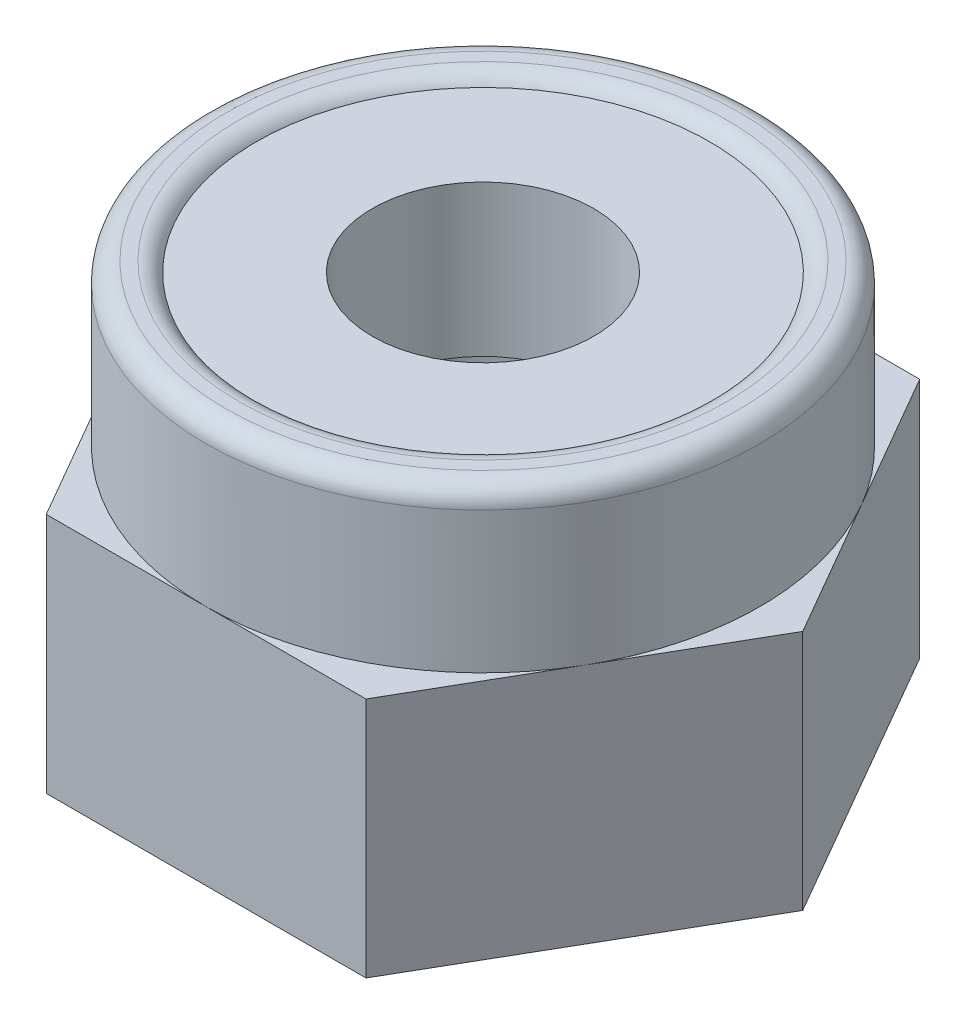
ISO-10303-21;
HEADER;
FILE_DESCRIPTION(('STEP AP214'),'2;1');
FILE_NAME('part.step','',(''),(''),'','','');
FILE_SCHEMA(('AUTOMOTIVE_DESIGN { 1 0 10303 214 1 1 1 1 }'));
ENDSEC;
DATA;
#1=APPLICATION_CONTEXT('core data for automotive mechanical design processes');
#2=APPLICATION_PROTOCOL_DEFINITION('international standard','automotive_design',2000,#1);
#3=PRODUCT_CONTEXT('',#1,'mechanical');
#4=PRODUCT('Part','Part','',(#3));
#5=PRODUCT_RELATED_PRODUCT_CATEGORY('part','',(#4));
#6=PRODUCT_DEFINITION_FORMATION('','',#4);
#7=PRODUCT_DEFINITION_CONTEXT('part definition',#1,'design');
#8=PRODUCT_DEFINITION('design','',#6,#7);
#9=PRODUCT_DEFINITION_SHAPE('','',#8);
#10=(LENGTH_UNIT() NAMED_UNIT(*) SI_UNIT(.MILLI.,.METRE.));
#11=(NAMED_UNIT(*) PLANE_ANGLE_UNIT() SI_UNIT($,.RADIAN.));
#12=(NAMED_UNIT(*) SI_UNIT($,.STERADIAN.) SOLID_ANGLE_UNIT());
#13=UNCERTAINTY_MEASURE_WITH_UNIT(LENGTH_MEASURE(1.E-05),#10,'distance_accuracy_value','');
#14=(GEOMETRIC_REPRESENTATION_CONTEXT(3) GLOBAL_UNCERTAINTY_ASSIGNED_CONTEXT((#13)) GLOBAL_UNIT_ASSIGNED_CONTEXT((#10,
#11,#12)) REPRESENTATION_CONTEXT('',''));
#15=CARTESIAN_POINT('',(0.,0.,0.));
#16=DIRECTION('',(0.,0.,1.));
#17=DIRECTION('',(1.,0.,0.));
#18=AXIS2_PLACEMENT_3D('',#15,#16,#17);
#19=CARTESIAN_POINT('',(0.,4.,0.));
#20=DIRECTION('',(0.,-1.,0.));
#21=DIRECTION('',(0.,0.,-1.));
#22=AXIS2_PLACEMENT_3D('',#19,#20,#21);
#23=CYLINDRICAL_SURFACE('',#22,1.1);
#24=CARTESIAN_POINT('',(0.,2.4,0.));
#25=DIRECTION('',(0.,1.,0.));
#26=DIRECTION('',(0.,0.,1.));
#27=AXIS2_PLACEMENT_3D('',#24,#25,#26);
#28=CIRCLE('',#27,1.1);
#29=CARTESIAN_POINT('',(0.,2.4,1.1));
#30=VERTEX_POINT('',#29);
#31=EDGE_CURVE('E134',#30,#30,#28,.T.);
#32=ORIENTED_EDGE('',*,*,#31,.F.);
#33=EDGE_LOOP('',(#32));
#34=FACE_BOUND('',#33,.T.);
#35=CARTESIAN_POINT('',(0.,3.9,0.));
#36=DIRECTION('',(0.,1.,0.));
#37=DIRECTION('',(0.,0.,1.));
#38=AXIS2_PLACEMENT_3D('',#35,#36,#37);
#39=CIRCLE('',#38,1.1);
#40=CARTESIAN_POINT('',(0.,3.9,1.1));
#41=VERTEX_POINT('',#40);
#42=EDGE_CURVE('E414',#41,#41,#39,.T.);
#43=ORIENTED_EDGE('',*,*,#42,.T.);
#44=EDGE_LOOP('',(#43));
#45=FACE_BOUND('',#44,.T.);
#46=ADVANCED_FACE('F34',(#34,#45),#23,.F.);
#47=CARTESIAN_POINT('',(-1.58771324027148,2.4,-2.75000000000001));
#48=DIRECTION('',(0.,1.,0.));
#49=DIRECTION('',(0.,0.,1.));
#50=AXIS2_PLACEMENT_3D('',#47,#48,#49);
#51=PLANE('',#50);
#52=CARTESIAN_POINT('',(0.,2.4,0.));
#53=DIRECTION('',(0.,1.,0.));
#54=DIRECTION('',(0.,0.,1.));
#55=AXIS2_PLACEMENT_3D('',#52,#53,#54);
#56=CIRCLE('',#55,2.74999999999999);
#57=CARTESIAN_POINT('',(0.,2.4,2.74999999999999));
#58=VERTEX_POINT('',#57);
#59=CARTESIAN_POINT('',(2.3815698604072,2.4,1.375));
#60=VERTEX_POINT('',#59);
#61=EDGE_CURVE('E129',#58,#60,#56,.T.);
#62=ORIENTED_EDGE('',*,*,#61,.F.);
#63=DIRECTION('',(1.,0.,0.));
#64=VECTOR('',#63,1.);
#65=CARTESIAN_POINT('',(-1.58771324027148,2.4,2.74999999999999));
#66=LINE('',#65,#64);
#67=CARTESIAN_POINT('',(1.58771324027147,2.4,2.74999999999999));
#68=VERTEX_POINT('',#67);
#69=EDGE_CURVE('E117',#58,#68,#66,.T.);
#70=ORIENTED_EDGE('',*,*,#69,.T.);
#71=DIRECTION('',(0.500000000000001,0.,-0.866025403784438));
#72=VECTOR('',#71,1.);
#73=CARTESIAN_POINT('',(1.58771324027147,2.4,2.74999999999999));
#74=LINE('',#73,#72);
#75=EDGE_CURVE('E131',#68,#60,#74,.T.);
#76=ORIENTED_EDGE('',*,*,#75,.T.);
#77=EDGE_LOOP('',(#62,#70,#76));
#78=FACE_BOUND('',#77,.T.);
#79=ADVANCED_FACE('F130',(#78),#51,.T.);
#80=CARTESIAN_POINT('',(2.3815698604072,2.4,-1.375));
#81=VERTEX_POINT('',#80);
#82=EDGE_CURVE('E57',#60,#81,#56,.T.);
#83=ORIENTED_EDGE('',*,*,#82,.F.);
#84=CARTESIAN_POINT('',(3.17542648054293,2.4,0.));
#85=VERTEX_POINT('',#84);
#86=EDGE_CURVE('E116',#60,#85,#74,.T.);
#87=ORIENTED_EDGE('',*,*,#86,.T.);
#88=DIRECTION('',(-0.5,0.,-0.866025403784439));
#89=VECTOR('',#88,1.);
#90=CARTESIAN_POINT('',(3.17542648054293,2.4,0.));
#91=LINE('',#90,#89);
#92=EDGE_CURVE('E165',#85,#81,#91,.T.);
#93=ORIENTED_EDGE('',*,*,#92,.T.);
#94=EDGE_LOOP('',(#83,#87,#93));
#95=FACE_BOUND('',#94,.T.);
#96=ADVANCED_FACE('F217',(#95),#51,.T.);
#97=CARTESIAN_POINT('',(0.,2.4,-2.75));
#98=VERTEX_POINT('',#97);
#99=EDGE_CURVE('E49',#81,#98,#56,.T.);
#100=ORIENTED_EDGE('',*,*,#99,.F.);
#101=CARTESIAN_POINT('',(1.58771324027146,2.4,-2.75));
#102=VERTEX_POINT('',#101);
#103=EDGE_CURVE('E164',#81,#102,#91,.T.);
#104=ORIENTED_EDGE('',*,*,#103,.T.);
#105=DIRECTION('',(-1.,0.,0.));
#106=VECTOR('',#105,1.);
#107=CARTESIAN_POINT('',(1.58771324027146,2.4,-2.75));
#108=LINE('',#107,#106);
#109=EDGE_CURVE('E154',#102,#98,#108,.T.);
#110=ORIENTED_EDGE('',*,*,#109,.T.);
#111=EDGE_LOOP('',(#100,#104,#110));
#112=FACE_BOUND('',#111,.T.);
#113=ADVANCED_FACE('F278',(#112),#51,.T.);
#114=CARTESIAN_POINT('',(-2.38156986040722,2.4,-1.37500000000001));
#115=VERTEX_POINT('',#114);
#116=EDGE_CURVE('E141',#98,#115,#56,.T.);
#117=ORIENTED_EDGE('',*,*,#116,.F.);
#118=CARTESIAN_POINT('',(-1.58771324027148,2.4,-2.75000000000001));
#119=VERTEX_POINT('',#118);
#120=EDGE_CURVE('E157',#98,#119,#108,.T.);
#121=ORIENTED_EDGE('',*,*,#120,.T.);
#122=DIRECTION('',(-0.5,0.,0.866025403784439));
#123=VECTOR('',#122,1.);
#124=CARTESIAN_POINT('',(-1.58771324027148,2.4,-2.75000000000001));
#125=LINE('',#124,#123);
#126=EDGE_CURVE('E158',#119,#115,#125,.T.);
#127=ORIENTED_EDGE('',*,*,#126,.T.);
#128=EDGE_LOOP('',(#117,#121,#127));
#129=FACE_BOUND('',#128,.T.);
#130=ADVANCED_FACE('F277',(#129),#51,.T.);
#131=CARTESIAN_POINT('',(-2.38156986040721,2.4,1.375));
#132=VERTEX_POINT('',#131);
#133=EDGE_CURVE('E139',#115,#132,#56,.T.);
#134=ORIENTED_EDGE('',*,*,#133,.F.);
#135=CARTESIAN_POINT('',(-3.17542648054295,2.4,0.));
#136=VERTEX_POINT('',#135);
#137=EDGE_CURVE('E156',#115,#136,#125,.T.);
#138=ORIENTED_EDGE('',*,*,#137,.T.);
#139=DIRECTION('',(0.5,0.,0.866025403784438));
#140=VECTOR('',#139,1.);
#141=CARTESIAN_POINT('',(-3.17542648054295,2.4,0.));
#142=LINE('',#141,#140);
#143=EDGE_CURVE('E127',#136,#132,#142,.T.);
#144=ORIENTED_EDGE('',*,*,#143,.T.);
#145=EDGE_LOOP('',(#134,#138,#144));
#146=FACE_BOUND('',#145,.T.);
#147=ADVANCED_FACE('F238',(#146),#51,.T.);
#148=EDGE_CURVE('E110',#132,#58,#56,.T.);
#149=ORIENTED_EDGE('',*,*,#148,.F.);
#150=CARTESIAN_POINT('',(-1.58771324027148,2.4,2.74999999999999));
#151=VERTEX_POINT('',#150);
#152=EDGE_CURVE('E112',#132,#151,#142,.T.);
#153=ORIENTED_EDGE('',*,*,#152,.T.);
#154=EDGE_CURVE('E106',#151,#58,#66,.T.);
#155=ORIENTED_EDGE('',*,*,#154,.T.);
#156=EDGE_LOOP('',(#149,#153,#155));
#157=FACE_BOUND('',#156,.T.);
#158=ADVANCED_FACE('F108',(#157),#51,.T.);
#159=CARTESIAN_POINT('',(-1.58771324027148,0.,-2.75000000000001));
#160=DIRECTION('',(0.,1.,0.));
#161=DIRECTION('',(0.,0.,1.));
#162=AXIS2_PLACEMENT_3D('',#159,#160,#161);
#163=PLANE('',#162);
#164=DIRECTION('',(-1.,0.,0.));
#165=VECTOR('',#164,1.);
#166=CARTESIAN_POINT('',(1.58771324027146,0.,-2.75));
#167=LINE('',#166,#165);
#168=CARTESIAN_POINT('',(1.58771324027146,0.,-2.75));
#169=VERTEX_POINT('',#168);
#170=CARTESIAN_POINT('',(-1.58771324027148,0.,-2.75000000000001));
#171=VERTEX_POINT('',#170);
#172=EDGE_CURVE('E153',#169,#171,#167,.T.);
#173=ORIENTED_EDGE('',*,*,#172,.F.);
#174=DIRECTION('',(-0.5,0.,-0.866025403784439));
#175=VECTOR('',#174,1.);
#176=CARTESIAN_POINT('',(3.17542648054293,0.,0.));
#177=LINE('',#176,#175);
#178=CARTESIAN_POINT('',(3.17542648054293,0.,0.));
#179=VERTEX_POINT('',#178);
#180=EDGE_CURVE('E178',#179,#169,#177,.T.);
#181=ORIENTED_EDGE('',*,*,#180,.F.);
#182=DIRECTION('',(0.500000000000001,0.,-0.866025403784438));
#183=VECTOR('',#182,1.);
#184=CARTESIAN_POINT('',(1.58771324027147,0.,2.74999999999999));
#185=LINE('',#184,#183);
#186=CARTESIAN_POINT('',(1.58771324027147,0.,2.74999999999999));
#187=VERTEX_POINT('',#186);
#188=EDGE_CURVE('E176',#187,#179,#185,.T.);
#189=ORIENTED_EDGE('',*,*,#188,.F.);
#190=DIRECTION('',(1.,0.,0.));
#191=VECTOR('',#190,1.);
#192=CARTESIAN_POINT('',(-1.58771324027148,0.,2.74999999999999));
#193=LINE('',#192,#191);
#194=CARTESIAN_POINT('',(-1.58771324027148,0.,2.74999999999999));
#195=VERTEX_POINT('',#194);
#196=EDGE_CURVE('E174',#195,#187,#193,.T.);
#197=ORIENTED_EDGE('',*,*,#196,.F.);
#198=DIRECTION('',(0.5,0.,0.866025403784438));
#199=VECTOR('',#198,1.);
#200=CARTESIAN_POINT('',(-3.17542648054295,0.,0.));
#201=LINE('',#200,#199);
#202=CARTESIAN_POINT('',(-3.17542648054295,0.,0.));
#203=VERTEX_POINT('',#202);
#204=EDGE_CURVE('E172',#203,#195,#201,.T.);
#205=ORIENTED_EDGE('',*,*,#204,.F.);
#206=DIRECTION('',(-0.5,0.,0.866025403784439));
#207=VECTOR('',#206,1.);
#208=CARTESIAN_POINT('',(-1.58771324027148,0.,-2.75000000000001));
#209=LINE('',#208,#207);
#210=EDGE_CURVE('E170',#171,#203,#209,.T.);
#211=ORIENTED_EDGE('',*,*,#210,.F.);
#212=EDGE_LOOP('',(#173,#181,#189,#197,#205,#211));
#213=FACE_BOUND('',#212,.T.);
#214=CARTESIAN_POINT('',(0.,0.,0.));
#215=DIRECTION('',(0.,1.,0.));
#216=DIRECTION('',(0.,0.,1.));
#217=AXIS2_PLACEMENT_3D('',#214,#215,#216);
#218=CIRCLE('',#217,1.25);
#219=CARTESIAN_POINT('',(0.,0.,1.25));
#220=VERTEX_POINT('',#219);
#221=EDGE_CURVE('E150',#220,#220,#218,.T.);
#222=ORIENTED_EDGE('',*,*,#221,.T.);
#223=EDGE_LOOP('',(#222));
#224=FACE_BOUND('',#223,.T.);
#225=ADVANCED_FACE('F237',(#213,#224),#163,.F.);
#226=CARTESIAN_POINT('',(1.58771324027146,2.4,-2.75));
#227=DIRECTION('',(0.,0.,1.));
#228=DIRECTION('',(1.,0.,0.));
#229=AXIS2_PLACEMENT_3D('',#226,#227,#228);
#230=PLANE('',#229);
#231=ORIENTED_EDGE('',*,*,#172,.T.);
#232=DIRECTION('',(0.,-1.,0.));
#233=VECTOR('',#232,1.);
#234=CARTESIAN_POINT('',(-1.58771324027148,2.4,-2.75000000000001));
#235=LINE('',#234,#233);
#236=EDGE_CURVE('E140',#119,#171,#235,.T.);
#237=ORIENTED_EDGE('',*,*,#236,.F.);
#238=ORIENTED_EDGE('',*,*,#120,.F.);
#239=ORIENTED_EDGE('',*,*,#109,.F.);
#240=DIRECTION('',(0.,-1.,0.));
#241=VECTOR('',#240,1.);
#242=CARTESIAN_POINT('',(1.58771324027146,2.4,-2.75));
#243=LINE('',#242,#241);
#244=EDGE_CURVE('E167',#102,#169,#243,.T.);
#245=ORIENTED_EDGE('',*,*,#244,.T.);
#246=EDGE_LOOP('',(#231,#237,#238,#239,#245));
#247=FACE_BOUND('',#246,.T.);
#248=ADVANCED_FACE('F241',(#247),#230,.F.);
#249=CARTESIAN_POINT('',(-1.58771324027148,2.4,-2.75000000000001));
#250=DIRECTION('',(0.866025403784439,0.,0.5));
#251=DIRECTION('',(0.5,0.,-0.866025403784439));
#252=AXIS2_PLACEMENT_3D('',#249,#250,#251);
#253=PLANE('',#252);
#254=ORIENTED_EDGE('',*,*,#210,.T.);
#255=DIRECTION('',(0.,-1.,0.));
#256=VECTOR('',#255,1.);
#257=CARTESIAN_POINT('',(-3.17542648054295,2.4,0.));
#258=LINE('',#257,#256);
#259=EDGE_CURVE('E143',#136,#203,#258,.T.);
#260=ORIENTED_EDGE('',*,*,#259,.F.);
#261=ORIENTED_EDGE('',*,*,#137,.F.);
#262=ORIENTED_EDGE('',*,*,#126,.F.);
#263=ORIENTED_EDGE('',*,*,#236,.T.);
#264=EDGE_LOOP('',(#254,#260,#261,#262,#263));
#265=FACE_BOUND('',#264,.T.);
#266=ADVANCED_FACE('F255',(#265),#253,.F.);
#267=CARTESIAN_POINT('',(-3.17542648054295,2.4,0.));
#268=DIRECTION('',(0.866025403784438,0.,-0.5));
#269=DIRECTION('',(-0.5,0.,-0.866025403784439));
#270=AXIS2_PLACEMENT_3D('',#267,#268,#269);
#271=PLANE('',#270);
#272=ORIENTED_EDGE('',*,*,#204,.T.);
#273=DIRECTION('',(0.,-1.,0.));
#274=VECTOR('',#273,1.);
#275=CARTESIAN_POINT('',(-1.58771324027148,2.4,2.74999999999999));
#276=LINE('',#275,#274);
#277=EDGE_CURVE('E186',#151,#195,#276,.T.);
#278=ORIENTED_EDGE('',*,*,#277,.F.);
#279=ORIENTED_EDGE('',*,*,#152,.F.);
#280=ORIENTED_EDGE('',*,*,#143,.F.);
#281=ORIENTED_EDGE('',*,*,#259,.T.);
#282=EDGE_LOOP('',(#272,#278,#279,#280,#281));
#283=FACE_BOUND('',#282,.T.);
#284=ADVANCED_FACE('F252',(#283),#271,.F.);
#285=CARTESIAN_POINT('',(-1.58771324027148,2.4,2.74999999999999));
#286=DIRECTION('',(0.,0.,-1.));
#287=DIRECTION('',(-1.,0.,0.));
#288=AXIS2_PLACEMENT_3D('',#285,#286,#287);
#289=PLANE('',#288);
#290=ORIENTED_EDGE('',*,*,#196,.T.);
#291=DIRECTION('',(0.,-1.,0.));
#292=VECTOR('',#291,1.);
#293=CARTESIAN_POINT('',(1.58771324027147,2.4,2.74999999999999));
#294=LINE('',#293,#292);
#295=EDGE_CURVE('E123',#68,#187,#294,.T.);
#296=ORIENTED_EDGE('',*,*,#295,.F.);
#297=ORIENTED_EDGE('',*,*,#69,.F.);
#298=ORIENTED_EDGE('',*,*,#154,.F.);
#299=ORIENTED_EDGE('',*,*,#277,.T.);
#300=EDGE_LOOP('',(#290,#296,#297,#298,#299));
#301=FACE_BOUND('',#300,.T.);
#302=ADVANCED_FACE('F121',(#301),#289,.F.);
#303=CARTESIAN_POINT('',(1.58771324027147,2.4,2.74999999999999));
#304=DIRECTION('',(-0.866025403784438,0.,-0.500000000000001));
#305=DIRECTION('',(-0.500000000000001,0.,0.866025403784438));
#306=AXIS2_PLACEMENT_3D('',#303,#304,#305);
#307=PLANE('',#306);
#308=ORIENTED_EDGE('',*,*,#188,.T.);
#309=DIRECTION('',(0.,-1.,0.));
#310=VECTOR('',#309,1.);
#311=CARTESIAN_POINT('',(3.17542648054293,2.4,0.));
#312=LINE('',#311,#310);
#313=EDGE_CURVE('E182',#85,#179,#312,.T.);
#314=ORIENTED_EDGE('',*,*,#313,.F.);
#315=ORIENTED_EDGE('',*,*,#86,.F.);
#316=ORIENTED_EDGE('',*,*,#75,.F.);
#317=ORIENTED_EDGE('',*,*,#295,.T.);
#318=EDGE_LOOP('',(#308,#314,#315,#316,#317));
#319=FACE_BOUND('',#318,.T.);
#320=ADVANCED_FACE('F245',(#319),#307,.F.);
#321=CARTESIAN_POINT('',(3.17542648054293,2.4,0.));
#322=DIRECTION('',(-0.866025403784439,0.,0.5));
#323=DIRECTION('',(0.5,0.,0.866025403784439));
#324=AXIS2_PLACEMENT_3D('',#321,#322,#323);
#325=PLANE('',#324);
#326=ORIENTED_EDGE('',*,*,#180,.T.);
#327=ORIENTED_EDGE('',*,*,#244,.F.);
#328=ORIENTED_EDGE('',*,*,#103,.F.);
#329=ORIENTED_EDGE('',*,*,#92,.F.);
#330=ORIENTED_EDGE('',*,*,#313,.T.);
#331=EDGE_LOOP('',(#326,#327,#328,#329,#330));
#332=FACE_BOUND('',#331,.T.);
#333=ADVANCED_FACE('F233',(#332),#325,.F.);
#334=CARTESIAN_POINT('',(0.,2.4,0.));
#335=DIRECTION('',(0.,-1.,0.));
#336=DIRECTION('',(0.,0.,-1.));
#337=AXIS2_PLACEMENT_3D('',#334,#335,#336);
#338=CYLINDRICAL_SURFACE('',#337,1.25);
#339=CARTESIAN_POINT('',(0.,2.4,0.));
#340=DIRECTION('',(0.,1.,0.));
#341=DIRECTION('',(0.,0.,1.));
#342=AXIS2_PLACEMENT_3D('',#339,#340,#341);
#343=CIRCLE('',#342,1.25);
#344=CARTESIAN_POINT('',(0.,2.4,1.25));
#345=VERTEX_POINT('',#344);
#346=EDGE_CURVE('E133',#345,#345,#343,.T.);
#347=ORIENTED_EDGE('',*,*,#346,.T.);
#348=EDGE_LOOP('',(#347));
#349=FACE_BOUND('',#348,.T.);
#350=ORIENTED_EDGE('',*,*,#221,.F.);
#351=EDGE_LOOP('',(#350));
#352=FACE_BOUND('',#351,.T.);
#353=ADVANCED_FACE('F225',(#349,#352),#338,.F.);
#354=CARTESIAN_POINT('',(0.,4.,0.));
#355=DIRECTION('',(0.,1.,0.));
#356=DIRECTION('',(0.,0.,1.));
#357=AXIS2_PLACEMENT_3D('',#354,#355,#356);
#358=PLANE('',#357);
#359=CARTESIAN_POINT('',(0.,4.,0.));
#360=DIRECTION('',(0.,1.,0.));
#361=DIRECTION('',(0.,0.,1.));
#362=AXIS2_PLACEMENT_3D('',#359,#360,#361);
#363=CIRCLE('',#362,2.54999999999999);
#364=CARTESIAN_POINT('',(0.,4.,2.54999999999999));
#365=VERTEX_POINT('',#364);
#366=EDGE_CURVE('E42',#365,#365,#363,.T.);
#367=ORIENTED_EDGE('',*,*,#366,.T.);
#368=EDGE_LOOP('',(#367));
#369=FACE_BOUND('',#368,.T.);
#370=CARTESIAN_POINT('',(0.,4.,0.));
#371=DIRECTION('',(0.,1.,0.));
#372=DIRECTION('',(0.,0.,1.));
#373=AXIS2_PLACEMENT_3D('',#370,#371,#372);
#374=CIRCLE('',#373,2.42320508075689);
#375=CARTESIAN_POINT('',(0.,4.,2.42320508075689));
#376=VERTEX_POINT('',#375);
#377=EDGE_CURVE('E190',#376,#376,#374,.F.);
#378=ORIENTED_EDGE('',*,*,#377,.T.);
#379=EDGE_LOOP('',(#378));
#380=FACE_BOUND('',#379,.T.);
#381=ADVANCED_FACE('F195',(#369,#380),#358,.T.);
#382=CARTESIAN_POINT('',(0.,2.4,0.));
#383=DIRECTION('',(0.,1.,0.));
#384=DIRECTION('',(0.,0.,1.));
#385=AXIS2_PLACEMENT_3D('',#382,#383,#384);
#386=PLANE('',#385);
#387=ORIENTED_EDGE('',*,*,#346,.F.);
#388=EDGE_LOOP('',(#387));
#389=FACE_BOUND('',#388,.T.);
#390=ORIENTED_EDGE('',*,*,#31,.T.);
#391=EDGE_LOOP('',(#390));
#392=FACE_BOUND('',#391,.T.);
#393=ADVANCED_FACE('F224',(#389,#392),#386,.F.);
#394=CARTESIAN_POINT('',(0.,4.,0.));
#395=DIRECTION('',(0.,-1.,0.));
#396=DIRECTION('',(0.,0.,-1.));
#397=AXIS2_PLACEMENT_3D('',#394,#395,#396);
#398=CYLINDRICAL_SURFACE('',#397,2.74999999999999);
#399=CARTESIAN_POINT('',(0.,3.8,0.));
#400=DIRECTION('',(0.,1.,0.));
#401=DIRECTION('',(0.,0.,1.));
#402=AXIS2_PLACEMENT_3D('',#399,#400,#401);
#403=CIRCLE('',#402,2.74999999999999);
#404=CARTESIAN_POINT('',(0.,3.8,2.74999999999999));
#405=VERTEX_POINT('',#404);
#406=EDGE_CURVE('E11',#405,#405,#403,.F.);
#407=ORIENTED_EDGE('',*,*,#406,.T.);
#408=EDGE_LOOP('',(#407));
#409=FACE_BOUND('',#408,.T.);
#410=ORIENTED_EDGE('',*,*,#61,.T.);
#411=ORIENTED_EDGE('',*,*,#82,.T.);
#412=ORIENTED_EDGE('',*,*,#99,.T.);
#413=ORIENTED_EDGE('',*,*,#116,.T.);
#414=ORIENTED_EDGE('',*,*,#133,.T.);
#415=ORIENTED_EDGE('',*,*,#148,.T.);
#416=EDGE_LOOP('',(#410,#411,#412,#413,#414,#415));
#417=FACE_BOUND('',#416,.T.);
#418=ADVANCED_FACE('F137',(#409,#417),#398,.T.);
#419=CARTESIAN_POINT('',(0.,3.9,0.));
#420=DIRECTION('',(0.,1.,0.));
#421=DIRECTION('',(0.,0.,1.));
#422=AXIS2_PLACEMENT_3D('',#419,#420,#421);
#423=PLANE('',#422);
#424=ORIENTED_EDGE('',*,*,#42,.F.);
#425=EDGE_LOOP('',(#424));
#426=FACE_BOUND('',#425,.T.);
#427=CARTESIAN_POINT('',(0.,3.9,0.));
#428=DIRECTION('',(0.,1.,0.));
#429=DIRECTION('',(0.,0.,1.));
#430=AXIS2_PLACEMENT_3D('',#427,#428,#429);
#431=CIRCLE('',#430,2.25);
#432=CARTESIAN_POINT('',(0.,3.9,2.25));
#433=VERTEX_POINT('',#432);
#434=EDGE_CURVE('E412',#433,#433,#431,.T.);
#435=ORIENTED_EDGE('',*,*,#434,.T.);
#436=EDGE_LOOP('',(#435));
#437=FACE_BOUND('',#436,.T.);
#438=ADVANCED_FACE('F200',(#426,#437),#423,.T.);
#439=CARTESIAN_POINT('',(0.,3.8,0.));
#440=DIRECTION('',(0.,1.,0.));
#441=DIRECTION('',(0.,0.,1.));
#442=AXIS2_PLACEMENT_3D('',#439,#440,#441);
#443=TOROIDAL_SURFACE('',#442,2.54999999999999,0.2);
#444=ORIENTED_EDGE('',*,*,#406,.F.);
#445=EDGE_LOOP('',(#444));
#446=FACE_BOUND('',#445,.T.);
#447=ORIENTED_EDGE('',*,*,#366,.F.);
#448=EDGE_LOOP('',(#447));
#449=FACE_BOUND('',#448,.T.);
#450=ADVANCED_FACE('F198',(#446,#449),#443,.T.);
#451=CARTESIAN_POINT('',(0.,3.8,0.));
#452=DIRECTION('',(0.,1.,0.));
#453=DIRECTION('',(0.,0.,1.));
#454=AXIS2_PLACEMENT_3D('',#451,#452,#453);
#455=TOROIDAL_SURFACE('',#454,2.42320508075689,0.2);
#456=ORIENTED_EDGE('',*,*,#377,.F.);
#457=EDGE_LOOP('',(#456));
#458=FACE_BOUND('',#457,.T.);
#459=ORIENTED_EDGE('',*,*,#434,.F.);
#460=EDGE_LOOP('',(#459));
#461=FACE_BOUND('',#460,.T.);
#462=ADVANCED_FACE('F36',(#458,#461),#455,.T.);
#463=CLOSED_SHELL('',(#46,#79,#96,#113,#130,#147,#158,#225,#248,#266,#284,#302,#320,#333,#353,
#381,#393,#418,#438,#450,#462));
#464=MANIFOLD_SOLID_BREP('B2',#463);
#465=ADVANCED_BREP_SHAPE_REPRESENTATION('',(#18,#464),#14);
#466=SHAPE_DEFINITION_REPRESENTATION(#9,#465);
ENDSEC;
END-ISO-10303-21;
